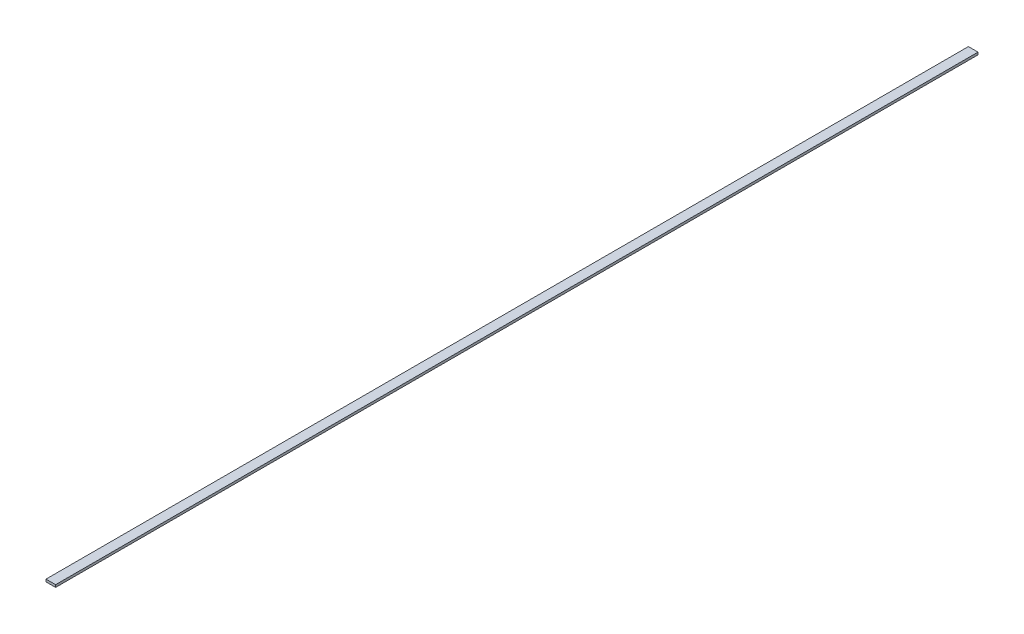
ISO-10303-21;
HEADER;
FILE_DESCRIPTION(('STEP AP214'),'2;1');
FILE_NAME('part.step','',(''),(''),'','','');
FILE_SCHEMA(('AUTOMOTIVE_DESIGN { 1 0 10303 214 1 1 1 1 }'));
ENDSEC;
DATA;
#1=APPLICATION_CONTEXT('core data for automotive mechanical design processes');
#2=APPLICATION_PROTOCOL_DEFINITION('international standard','automotive_design',2000,#1);
#3=PRODUCT_CONTEXT('',#1,'mechanical');
#4=PRODUCT('Part','Part','',(#3));
#5=PRODUCT_RELATED_PRODUCT_CATEGORY('part','',(#4));
#6=PRODUCT_DEFINITION_FORMATION('','',#4);
#7=PRODUCT_DEFINITION_CONTEXT('part definition',#1,'design');
#8=PRODUCT_DEFINITION('design','',#6,#7);
#9=PRODUCT_DEFINITION_SHAPE('','',#8);
#10=(LENGTH_UNIT() NAMED_UNIT(*) SI_UNIT(.MILLI.,.METRE.));
#11=(NAMED_UNIT(*) PLANE_ANGLE_UNIT() SI_UNIT($,.RADIAN.));
#12=(NAMED_UNIT(*) SI_UNIT($,.STERADIAN.) SOLID_ANGLE_UNIT());
#13=UNCERTAINTY_MEASURE_WITH_UNIT(LENGTH_MEASURE(1.E-05),#10,'distance_accuracy_value','');
#14=(GEOMETRIC_REPRESENTATION_CONTEXT(3) GLOBAL_UNCERTAINTY_ASSIGNED_CONTEXT((#13)) GLOBAL_UNIT_ASSIGNED_CONTEXT((#10,
#11,#12)) REPRESENTATION_CONTEXT('',''));
#15=CARTESIAN_POINT('',(0.,0.,0.));
#16=DIRECTION('',(0.,0.,1.));
#17=DIRECTION('',(1.,0.,0.));
#18=AXIS2_PLACEMENT_3D('',#15,#16,#17);
#19=CARTESIAN_POINT('',(6.34999999999997,1.5875,609.6));
#20=DIRECTION('',(-1.,0.,0.));
#21=DIRECTION('',(0.,0.,1.));
#22=AXIS2_PLACEMENT_3D('',#19,#20,#21);
#23=PLANE('',#22);
#24=DIRECTION('',(0.,0.,-1.));
#25=VECTOR('',#24,1.);
#26=CARTESIAN_POINT('',(6.34999999999997,-1.5875,609.6));
#27=LINE('',#26,#25);
#28=CARTESIAN_POINT('',(6.34999999999997,-1.5875,609.6));
#29=VERTEX_POINT('',#28);
#30=CARTESIAN_POINT('',(6.34999999999997,-1.5875,-609.6));
#31=VERTEX_POINT('',#30);
#32=EDGE_CURVE('E98',#29,#31,#27,.T.);
#33=ORIENTED_EDGE('',*,*,#32,.T.);
#34=DIRECTION('',(0.,-1.,0.));
#35=VECTOR('',#34,1.);
#36=CARTESIAN_POINT('',(6.34999999999997,1.5875,-609.6));
#37=LINE('',#36,#35);
#38=CARTESIAN_POINT('',(6.34999999999997,1.5875,-609.6));
#39=VERTEX_POINT('',#38);
#40=EDGE_CURVE('E11',#39,#31,#37,.T.);
#41=ORIENTED_EDGE('',*,*,#40,.F.);
#42=DIRECTION('',(0.,0.,-1.));
#43=VECTOR('',#42,1.);
#44=CARTESIAN_POINT('',(6.34999999999997,1.5875,609.6));
#45=LINE('',#44,#43);
#46=CARTESIAN_POINT('',(6.34999999999997,1.5875,609.6));
#47=VERTEX_POINT('',#46);
#48=EDGE_CURVE('E86',#47,#39,#45,.T.);
#49=ORIENTED_EDGE('',*,*,#48,.F.);
#50=DIRECTION('',(0.,-1.,0.));
#51=VECTOR('',#50,1.);
#52=CARTESIAN_POINT('',(6.34999999999997,1.5875,609.6));
#53=LINE('',#52,#51);
#54=EDGE_CURVE('E94',#47,#29,#53,.T.);
#55=ORIENTED_EDGE('',*,*,#54,.T.);
#56=EDGE_LOOP('',(#33,#41,#49,#55));
#57=FACE_BOUND('',#56,.T.);
#58=ADVANCED_FACE('F35',(#57),#23,.F.);
#59=CARTESIAN_POINT('',(-6.34999999999997,1.5875,-609.6));
#60=DIRECTION('',(0.,0.,1.));
#61=DIRECTION('',(1.,0.,0.));
#62=AXIS2_PLACEMENT_3D('',#59,#60,#61);
#63=PLANE('',#62);
#64=DIRECTION('',(-1.,0.,0.));
#65=VECTOR('',#64,1.);
#66=CARTESIAN_POINT('',(-6.34999999999997,-1.5875,-609.6));
#67=LINE('',#66,#65);
#68=CARTESIAN_POINT('',(-6.34999999999997,-1.5875,-609.6));
#69=VERTEX_POINT('',#68);
#70=EDGE_CURVE('E90',#31,#69,#67,.T.);
#71=ORIENTED_EDGE('',*,*,#70,.T.);
#72=DIRECTION('',(0.,-1.,0.));
#73=VECTOR('',#72,1.);
#74=CARTESIAN_POINT('',(-6.34999999999997,1.5875,-609.6));
#75=LINE('',#74,#73);
#76=CARTESIAN_POINT('',(-6.34999999999997,1.5875,-609.6));
#77=VERTEX_POINT('',#76);
#78=EDGE_CURVE('E43',#77,#69,#75,.T.);
#79=ORIENTED_EDGE('',*,*,#78,.F.);
#80=DIRECTION('',(-1.,0.,0.));
#81=VECTOR('',#80,1.);
#82=CARTESIAN_POINT('',(-6.34999999999997,1.5875,-609.6));
#83=LINE('',#82,#81);
#84=EDGE_CURVE('E81',#39,#77,#83,.T.);
#85=ORIENTED_EDGE('',*,*,#84,.F.);
#86=ORIENTED_EDGE('',*,*,#40,.T.);
#87=EDGE_LOOP('',(#71,#79,#85,#86));
#88=FACE_BOUND('',#87,.T.);
#89=ADVANCED_FACE('F89',(#88),#63,.F.);
#90=CARTESIAN_POINT('',(-6.34999999999997,1.5875,609.6));
#91=DIRECTION('',(1.,0.,0.));
#92=DIRECTION('',(0.,0.,-1.));
#93=AXIS2_PLACEMENT_3D('',#90,#91,#92);
#94=PLANE('',#93);
#95=DIRECTION('',(0.,0.,1.));
#96=VECTOR('',#95,1.);
#97=CARTESIAN_POINT('',(-6.34999999999997,-1.5875,609.6));
#98=LINE('',#97,#96);
#99=CARTESIAN_POINT('',(-6.34999999999997,-1.5875,609.6));
#100=VERTEX_POINT('',#99);
#101=EDGE_CURVE('E68',#69,#100,#98,.T.);
#102=ORIENTED_EDGE('',*,*,#101,.T.);
#103=DIRECTION('',(0.,-1.,0.));
#104=VECTOR('',#103,1.);
#105=CARTESIAN_POINT('',(-6.34999999999997,1.5875,609.6));
#106=LINE('',#105,#104);
#107=CARTESIAN_POINT('',(-6.34999999999997,1.5875,609.6));
#108=VERTEX_POINT('',#107);
#109=EDGE_CURVE('E91',#108,#100,#106,.T.);
#110=ORIENTED_EDGE('',*,*,#109,.F.);
#111=DIRECTION('',(0.,0.,1.));
#112=VECTOR('',#111,1.);
#113=CARTESIAN_POINT('',(-6.34999999999997,1.5875,609.6));
#114=LINE('',#113,#112);
#115=EDGE_CURVE('E84',#77,#108,#114,.T.);
#116=ORIENTED_EDGE('',*,*,#115,.F.);
#117=ORIENTED_EDGE('',*,*,#78,.T.);
#118=EDGE_LOOP('',(#102,#110,#116,#117));
#119=FACE_BOUND('',#118,.T.);
#120=ADVANCED_FACE('F92',(#119),#94,.F.);
#121=CARTESIAN_POINT('',(-6.34999999999997,1.5875,609.6));
#122=DIRECTION('',(0.,0.,-1.));
#123=DIRECTION('',(-1.,0.,0.));
#124=AXIS2_PLACEMENT_3D('',#121,#122,#123);
#125=PLANE('',#124);
#126=DIRECTION('',(1.,0.,0.));
#127=VECTOR('',#126,1.);
#128=CARTESIAN_POINT('',(-6.34999999999997,-1.5875,609.6));
#129=LINE('',#128,#127);
#130=EDGE_CURVE('E74',#100,#29,#129,.T.);
#131=ORIENTED_EDGE('',*,*,#130,.T.);
#132=ORIENTED_EDGE('',*,*,#54,.F.);
#133=DIRECTION('',(1.,0.,0.));
#134=VECTOR('',#133,1.);
#135=CARTESIAN_POINT('',(-6.34999999999997,1.5875,609.6));
#136=LINE('',#135,#134);
#137=EDGE_CURVE('E51',#108,#47,#136,.T.);
#138=ORIENTED_EDGE('',*,*,#137,.F.);
#139=ORIENTED_EDGE('',*,*,#109,.T.);
#140=EDGE_LOOP('',(#131,#132,#138,#139));
#141=FACE_BOUND('',#140,.T.);
#142=ADVANCED_FACE('F105',(#141),#125,.F.);
#143=CARTESIAN_POINT('',(0.,1.5875,0.));
#144=DIRECTION('',(0.,-1.,0.));
#145=DIRECTION('',(0.,0.,-1.));
#146=AXIS2_PLACEMENT_3D('',#143,#144,#145);
#147=PLANE('',#146);
#148=ORIENTED_EDGE('',*,*,#48,.T.);
#149=ORIENTED_EDGE('',*,*,#84,.T.);
#150=ORIENTED_EDGE('',*,*,#115,.T.);
#151=ORIENTED_EDGE('',*,*,#137,.T.);
#152=EDGE_LOOP('',(#148,#149,#150,#151));
#153=FACE_BOUND('',#152,.T.);
#154=ADVANCED_FACE('F82',(#153),#147,.F.);
#155=CARTESIAN_POINT('',(0.,-1.5875,0.));
#156=DIRECTION('',(0.,-1.,0.));
#157=DIRECTION('',(0.,0.,-1.));
#158=AXIS2_PLACEMENT_3D('',#155,#156,#157);
#159=PLANE('',#158);
#160=ORIENTED_EDGE('',*,*,#32,.F.);
#161=ORIENTED_EDGE('',*,*,#130,.F.);
#162=ORIENTED_EDGE('',*,*,#101,.F.);
#163=ORIENTED_EDGE('',*,*,#70,.F.);
#164=EDGE_LOOP('',(#160,#161,#162,#163));
#165=FACE_BOUND('',#164,.T.);
#166=ADVANCED_FACE('F108',(#165),#159,.T.);
#167=CLOSED_SHELL('',(#58,#89,#120,#142,#154,#166));
#168=MANIFOLD_SOLID_BREP('B2',#167);
#169=ADVANCED_BREP_SHAPE_REPRESENTATION('',(#18,#168),#14);
#170=SHAPE_DEFINITION_REPRESENTATION(#9,#169);
ENDSEC;
END-ISO-10303-21;
